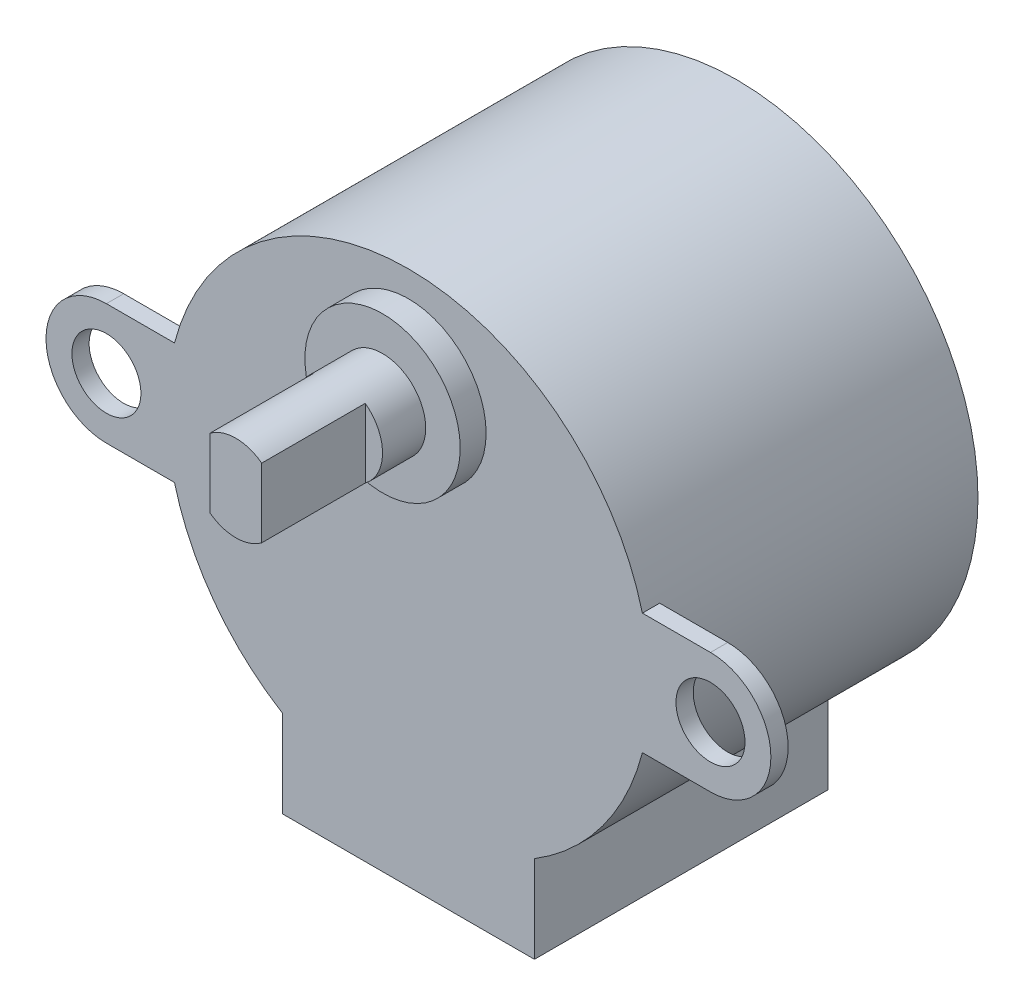
ISO-10303-21;
HEADER;
FILE_DESCRIPTION(('STEP AP214'),'2;1');
FILE_NAME('part.step','',(''),(''),'','','');
FILE_SCHEMA(('AUTOMOTIVE_DESIGN { 1 0 10303 214 1 1 1 1 }'));
ENDSEC;
DATA;
#1=APPLICATION_CONTEXT('core data for automotive mechanical design processes');
#2=APPLICATION_PROTOCOL_DEFINITION('international standard','automotive_design',2000,#1);
#3=PRODUCT_CONTEXT('',#1,'mechanical');
#4=PRODUCT('Part','Part','',(#3));
#5=PRODUCT_RELATED_PRODUCT_CATEGORY('part','',(#4));
#6=PRODUCT_DEFINITION_FORMATION('','',#4);
#7=PRODUCT_DEFINITION_CONTEXT('part definition',#1,'design');
#8=PRODUCT_DEFINITION('design','',#6,#7);
#9=PRODUCT_DEFINITION_SHAPE('','',#8);
#10=(LENGTH_UNIT() NAMED_UNIT(*) SI_UNIT(.MILLI.,.METRE.));
#11=(NAMED_UNIT(*) PLANE_ANGLE_UNIT() SI_UNIT($,.RADIAN.));
#12=(NAMED_UNIT(*) SI_UNIT($,.STERADIAN.) SOLID_ANGLE_UNIT());
#13=UNCERTAINTY_MEASURE_WITH_UNIT(LENGTH_MEASURE(1.E-05),#10,'distance_accuracy_value','');
#14=(GEOMETRIC_REPRESENTATION_CONTEXT(3) GLOBAL_UNCERTAINTY_ASSIGNED_CONTEXT((#13)) GLOBAL_UNIT_ASSIGNED_CONTEXT((#10,
#11,#12)) REPRESENTATION_CONTEXT('',''));
#15=CARTESIAN_POINT('',(0.,0.,0.));
#16=DIRECTION('',(0.,0.,1.));
#17=DIRECTION('',(1.,0.,0.));
#18=AXIS2_PLACEMENT_3D('',#15,#16,#17);
#19=CARTESIAN_POINT('',(0.,8.,23.));
#20=DIRECTION('',(0.,0.,1.));
#21=DIRECTION('',(1.,0.,0.));
#22=AXIS2_PLACEMENT_3D('',#19,#20,#21);
#23=PLANE('',#22);
#24=DIRECTION('',(0.,-1.,0.));
#25=VECTOR('',#24,1.);
#26=CARTESIAN_POINT('',(-1.5,6.,23.));
#27=LINE('',#26,#25);
#28=CARTESIAN_POINT('',(-1.5,10.,23.));
#29=VERTEX_POINT('',#28);
#30=CARTESIAN_POINT('',(-1.5,6.,23.));
#31=VERTEX_POINT('',#30);
#32=EDGE_CURVE('E166',#29,#31,#27,.T.);
#33=ORIENTED_EDGE('',*,*,#32,.F.);
#34=CARTESIAN_POINT('',(0.,8.,23.));
#35=DIRECTION('',(0.,0.,1.));
#36=DIRECTION('',(1.,0.,0.));
#37=AXIS2_PLACEMENT_3D('',#34,#35,#36);
#38=CIRCLE('',#37,2.5);
#39=EDGE_CURVE('E55',#29,#31,#38,.T.);
#40=ORIENTED_EDGE('',*,*,#39,.T.);
#41=EDGE_LOOP('',(#33,#40));
#42=FACE_BOUND('',#41,.T.);
#43=ADVANCED_FACE('F34',(#42),#23,.T.);
#44=CARTESIAN_POINT('',(0.,0.,19.));
#45=DIRECTION('',(0.,0.,-1.));
#46=DIRECTION('',(-1.,0.,0.));
#47=AXIS2_PLACEMENT_3D('',#44,#45,#46);
#48=CYLINDRICAL_SURFACE('',#47,14.);
#49=CARTESIAN_POINT('',(0.,0.,19.));
#50=DIRECTION('',(0.,0.,1.));
#51=DIRECTION('',(1.,0.,0.));
#52=AXIS2_PLACEMENT_3D('',#49,#50,#51);
#53=CIRCLE('',#52,14.);
#54=CARTESIAN_POINT('',(7.3,-11.9461290801665,19.));
#55=VERTEX_POINT('',#54);
#56=CARTESIAN_POINT('',(13.555441711726,-3.5,19.));
#57=VERTEX_POINT('',#56);
#58=EDGE_CURVE('E283',#55,#57,#53,.T.);
#59=ORIENTED_EDGE('',*,*,#58,.F.);
#60=DIRECTION('',(0.,0.,-1.));
#61=VECTOR('',#60,1.);
#62=CARTESIAN_POINT('',(7.3,-11.9461290801665,19.));
#63=LINE('',#62,#61);
#64=CARTESIAN_POINT('',(7.3,-11.9461290801665,2.));
#65=VERTEX_POINT('',#64);
#66=EDGE_CURVE('E199',#55,#65,#63,.T.);
#67=ORIENTED_EDGE('',*,*,#66,.T.);
#68=CARTESIAN_POINT('',(0.,0.,2.));
#69=DIRECTION('',(0.,0.,-1.));
#70=DIRECTION('',(-1.,0.,0.));
#71=AXIS2_PLACEMENT_3D('',#68,#69,#70);
#72=CIRCLE('',#71,14.);
#73=CARTESIAN_POINT('',(-7.3,-11.9461290801665,2.));
#74=VERTEX_POINT('',#73);
#75=EDGE_CURVE('E11',#65,#74,#72,.T.);
#76=ORIENTED_EDGE('',*,*,#75,.T.);
#77=DIRECTION('',(0.,0.,-1.));
#78=VECTOR('',#77,1.);
#79=CARTESIAN_POINT('',(-7.3,-11.9461290801665,19.));
#80=LINE('',#79,#78);
#81=CARTESIAN_POINT('',(-7.3,-11.9461290801665,19.));
#82=VERTEX_POINT('',#81);
#83=EDGE_CURVE('E194',#74,#82,#80,.F.);
#84=ORIENTED_EDGE('',*,*,#83,.T.);
#85=CARTESIAN_POINT('',(-13.555441711726,-3.50000000000001,19.));
#86=VERTEX_POINT('',#85);
#87=EDGE_CURVE('E282',#86,#82,#53,.T.);
#88=ORIENTED_EDGE('',*,*,#87,.F.);
#89=DIRECTION('',(0.,0.,1.));
#90=VECTOR('',#89,1.);
#91=CARTESIAN_POINT('',(-13.555441711726,-3.50000000000001,18.));
#92=LINE('',#91,#90);
#93=CARTESIAN_POINT('',(-13.555441711726,-3.50000000000001,18.));
#94=VERTEX_POINT('',#93);
#95=EDGE_CURVE('E233',#94,#86,#92,.T.);
#96=ORIENTED_EDGE('',*,*,#95,.F.);
#97=CARTESIAN_POINT('',(0.,0.,18.));
#98=DIRECTION('',(0.,0.,1.));
#99=DIRECTION('',(1.,0.,0.));
#100=AXIS2_PLACEMENT_3D('',#97,#98,#99);
#101=CIRCLE('',#100,14.);
#102=CARTESIAN_POINT('',(-13.555441711726,3.49999999999999,18.));
#103=VERTEX_POINT('',#102);
#104=EDGE_CURVE('E210',#103,#94,#101,.T.);
#105=ORIENTED_EDGE('',*,*,#104,.F.);
#106=DIRECTION('',(0.,0.,1.));
#107=VECTOR('',#106,1.);
#108=CARTESIAN_POINT('',(-13.555441711726,3.49999999999999,18.));
#109=LINE('',#108,#107);
#110=CARTESIAN_POINT('',(-13.555441711726,3.49999999999999,19.));
#111=VERTEX_POINT('',#110);
#112=EDGE_CURVE('E230',#103,#111,#109,.T.);
#113=ORIENTED_EDGE('',*,*,#112,.T.);
#114=CARTESIAN_POINT('',(13.555441711726,3.5,19.));
#115=VERTEX_POINT('',#114);
#116=EDGE_CURVE('E42',#115,#111,#53,.T.);
#117=ORIENTED_EDGE('',*,*,#116,.F.);
#118=DIRECTION('',(0.,0.,1.));
#119=VECTOR('',#118,1.);
#120=CARTESIAN_POINT('',(13.555441711726,3.5,18.));
#121=LINE('',#120,#119);
#122=CARTESIAN_POINT('',(13.555441711726,3.5,18.));
#123=VERTEX_POINT('',#122);
#124=EDGE_CURVE('E265',#123,#115,#121,.T.);
#125=ORIENTED_EDGE('',*,*,#124,.F.);
#126=CARTESIAN_POINT('',(0.,0.,18.));
#127=DIRECTION('',(0.,0.,1.));
#128=DIRECTION('',(1.,0.,0.));
#129=AXIS2_PLACEMENT_3D('',#126,#127,#128);
#130=CIRCLE('',#129,14.);
#131=CARTESIAN_POINT('',(13.555441711726,-3.5,18.));
#132=VERTEX_POINT('',#131);
#133=EDGE_CURVE('E249',#132,#123,#130,.T.);
#134=ORIENTED_EDGE('',*,*,#133,.F.);
#135=DIRECTION('',(0.,0.,1.));
#136=VECTOR('',#135,1.);
#137=CARTESIAN_POINT('',(13.555441711726,-3.5,18.));
#138=LINE('',#137,#136);
#139=EDGE_CURVE('E261',#132,#57,#138,.T.);
#140=ORIENTED_EDGE('',*,*,#139,.T.);
#141=EDGE_LOOP('',(#59,#67,#76,#84,#88,#96,#105,#113,#117,#125,#134,#140));
#142=FACE_BOUND('',#141,.T.);
#143=CARTESIAN_POINT('',(0.,0.,0.));
#144=DIRECTION('',(0.,0.,1.));
#145=DIRECTION('',(1.,0.,0.));
#146=AXIS2_PLACEMENT_3D('',#143,#144,#145);
#147=CIRCLE('',#146,14.);
#148=CARTESIAN_POINT('',(14.,0.,0.));
#149=VERTEX_POINT('',#148);
#150=EDGE_CURVE('E277',#149,#149,#147,.T.);
#151=ORIENTED_EDGE('',*,*,#150,.T.);
#152=EDGE_LOOP('',(#151));
#153=FACE_BOUND('',#152,.T.);
#154=ADVANCED_FACE('F36',(#142,#153),#48,.T.);
#155=CARTESIAN_POINT('',(0.,0.,19.));
#156=DIRECTION('',(0.,0.,1.));
#157=DIRECTION('',(1.,0.,0.));
#158=AXIS2_PLACEMENT_3D('',#155,#156,#157);
#159=PLANE('',#158);
#160=ORIENTED_EDGE('',*,*,#87,.T.);
#161=DIRECTION('',(0.,-1.,0.));
#162=VECTOR('',#161,1.);
#163=CARTESIAN_POINT('',(-7.3,-17.,19.));
#164=LINE('',#163,#162);
#165=CARTESIAN_POINT('',(-7.3,-17.,19.));
#166=VERTEX_POINT('',#165);
#167=EDGE_CURVE('E173',#82,#166,#164,.T.);
#168=ORIENTED_EDGE('',*,*,#167,.T.);
#169=DIRECTION('',(1.,0.,0.));
#170=VECTOR('',#169,1.);
#171=CARTESIAN_POINT('',(-7.3,-17.,19.));
#172=LINE('',#171,#170);
#173=CARTESIAN_POINT('',(7.3,-17.,19.));
#174=VERTEX_POINT('',#173);
#175=EDGE_CURVE('E183',#166,#174,#172,.T.);
#176=ORIENTED_EDGE('',*,*,#175,.T.);
#177=DIRECTION('',(0.,1.,0.));
#178=VECTOR('',#177,1.);
#179=CARTESIAN_POINT('',(7.3,-17.,19.));
#180=LINE('',#179,#178);
#181=EDGE_CURVE('E171',#174,#55,#180,.T.);
#182=ORIENTED_EDGE('',*,*,#181,.T.);
#183=ORIENTED_EDGE('',*,*,#58,.T.);
#184=DIRECTION('',(-1.,0.,0.));
#185=VECTOR('',#184,1.);
#186=CARTESIAN_POINT('',(0.,-3.5,19.));
#187=LINE('',#186,#185);
#188=CARTESIAN_POINT('',(17.5,-3.5,19.));
#189=VERTEX_POINT('',#188);
#190=EDGE_CURVE('E254',#189,#57,#187,.T.);
#191=ORIENTED_EDGE('',*,*,#190,.F.);
#192=CARTESIAN_POINT('',(17.5,0.,19.));
#193=DIRECTION('',(0.,0.,1.));
#194=DIRECTION('',(1.,0.,0.));
#195=AXIS2_PLACEMENT_3D('',#192,#193,#194);
#196=CIRCLE('',#195,3.5);
#197=CARTESIAN_POINT('',(17.5,3.5,19.));
#198=VERTEX_POINT('',#197);
#199=EDGE_CURVE('E257',#189,#198,#196,.T.);
#200=ORIENTED_EDGE('',*,*,#199,.T.);
#201=DIRECTION('',(-1.,0.,0.));
#202=VECTOR('',#201,1.);
#203=CARTESIAN_POINT('',(0.,3.5,19.));
#204=LINE('',#203,#202);
#205=EDGE_CURVE('E241',#198,#115,#204,.T.);
#206=ORIENTED_EDGE('',*,*,#205,.T.);
#207=ORIENTED_EDGE('',*,*,#116,.T.);
#208=DIRECTION('',(1.,0.,0.));
#209=VECTOR('',#208,1.);
#210=CARTESIAN_POINT('',(0.,3.49999999999999,19.));
#211=LINE('',#210,#209);
#212=CARTESIAN_POINT('',(-17.5,3.49999999999999,19.));
#213=VERTEX_POINT('',#212);
#214=EDGE_CURVE('E222',#213,#111,#211,.T.);
#215=ORIENTED_EDGE('',*,*,#214,.F.);
#216=CARTESIAN_POINT('',(-17.5,0.,19.));
#217=DIRECTION('',(0.,0.,1.));
#218=DIRECTION('',(1.,0.,0.));
#219=AXIS2_PLACEMENT_3D('',#216,#217,#218);
#220=CIRCLE('',#219,3.5);
#221=CARTESIAN_POINT('',(-17.5,-3.50000000000001,19.));
#222=VERTEX_POINT('',#221);
#223=EDGE_CURVE('E202',#222,#213,#220,.F.);
#224=ORIENTED_EDGE('',*,*,#223,.F.);
#225=DIRECTION('',(1.,0.,0.));
#226=VECTOR('',#225,1.);
#227=CARTESIAN_POINT('',(0.,-3.50000000000001,19.));
#228=LINE('',#227,#226);
#229=EDGE_CURVE('E220',#222,#86,#228,.T.);
#230=ORIENTED_EDGE('',*,*,#229,.T.);
#231=EDGE_LOOP('',(#160,#168,#176,#182,#183,#191,#200,#206,#207,#215,#224,#230));
#232=FACE_BOUND('',#231,.T.);
#233=CARTESIAN_POINT('',(0.,8.,19.));
#234=DIRECTION('',(0.,0.,1.));
#235=DIRECTION('',(1.,0.,0.));
#236=AXIS2_PLACEMENT_3D('',#233,#234,#235);
#237=CIRCLE('',#236,4.5);
#238=CARTESIAN_POINT('',(4.5,8.,19.));
#239=VERTEX_POINT('',#238);
#240=EDGE_CURVE('E278',#239,#239,#237,.T.);
#241=ORIENTED_EDGE('',*,*,#240,.F.);
#242=EDGE_LOOP('',(#241));
#243=FACE_BOUND('',#242,.T.);
#244=CARTESIAN_POINT('',(17.5,0.,19.));
#245=DIRECTION('',(0.,0.,1.));
#246=DIRECTION('',(1.,0.,0.));
#247=AXIS2_PLACEMENT_3D('',#244,#245,#246);
#248=CIRCLE('',#247,2.);
#249=CARTESIAN_POINT('',(19.5,0.,19.));
#250=VERTEX_POINT('',#249);
#251=EDGE_CURVE('E229',#250,#250,#248,.T.);
#252=ORIENTED_EDGE('',*,*,#251,.F.);
#253=EDGE_LOOP('',(#252));
#254=FACE_BOUND('',#253,.T.);
#255=CARTESIAN_POINT('',(-17.5,0.,19.));
#256=DIRECTION('',(0.,0.,1.));
#257=DIRECTION('',(1.,0.,0.));
#258=AXIS2_PLACEMENT_3D('',#255,#256,#257);
#259=CIRCLE('',#258,2.);
#260=CARTESIAN_POINT('',(-15.5,0.,19.));
#261=VERTEX_POINT('',#260);
#262=EDGE_CURVE('E207',#261,#261,#259,.F.);
#263=ORIENTED_EDGE('',*,*,#262,.T.);
#264=EDGE_LOOP('',(#263));
#265=FACE_BOUND('',#264,.T.);
#266=ADVANCED_FACE('F292',(#232,#243,#254,#265),#159,.T.);
#267=CARTESIAN_POINT('',(0.,0.,0.));
#268=DIRECTION('',(0.,0.,1.));
#269=DIRECTION('',(1.,0.,0.));
#270=AXIS2_PLACEMENT_3D('',#267,#268,#269);
#271=PLANE('',#270);
#272=ORIENTED_EDGE('',*,*,#150,.F.);
#273=EDGE_LOOP('',(#272));
#274=FACE_BOUND('',#273,.T.);
#275=ADVANCED_FACE('F353',(#274),#271,.F.);
#276=CARTESIAN_POINT('',(0.,8.,20.5));
#277=DIRECTION('',(0.,0.,-1.));
#278=DIRECTION('',(-1.,0.,0.));
#279=AXIS2_PLACEMENT_3D('',#276,#277,#278);
#280=CYLINDRICAL_SURFACE('',#279,4.5);
#281=CARTESIAN_POINT('',(0.,8.,20.5));
#282=DIRECTION('',(0.,0.,1.));
#283=DIRECTION('',(1.,0.,0.));
#284=AXIS2_PLACEMENT_3D('',#281,#282,#283);
#285=CIRCLE('',#284,4.5);
#286=CARTESIAN_POINT('',(4.5,8.,20.5));
#287=VERTEX_POINT('',#286);
#288=EDGE_CURVE('E274',#287,#287,#285,.T.);
#289=ORIENTED_EDGE('',*,*,#288,.F.);
#290=EDGE_LOOP('',(#289));
#291=FACE_BOUND('',#290,.T.);
#292=ORIENTED_EDGE('',*,*,#240,.T.);
#293=EDGE_LOOP('',(#292));
#294=FACE_BOUND('',#293,.T.);
#295=ADVANCED_FACE('F359',(#291,#294),#280,.T.);
#296=CARTESIAN_POINT('',(0.,8.,20.5));
#297=DIRECTION('',(0.,0.,1.));
#298=DIRECTION('',(1.,0.,0.));
#299=AXIS2_PLACEMENT_3D('',#296,#297,#298);
#300=PLANE('',#299);
#301=CARTESIAN_POINT('',(0.,8.,20.5));
#302=DIRECTION('',(0.,0.,1.));
#303=DIRECTION('',(1.,0.,0.));
#304=AXIS2_PLACEMENT_3D('',#301,#302,#303);
#305=CIRCLE('',#304,2.5);
#306=CARTESIAN_POINT('',(2.5,8.,20.5));
#307=VERTEX_POINT('',#306);
#308=EDGE_CURVE('E264',#307,#307,#305,.T.);
#309=ORIENTED_EDGE('',*,*,#308,.F.);
#310=EDGE_LOOP('',(#309));
#311=FACE_BOUND('',#310,.T.);
#312=ORIENTED_EDGE('',*,*,#288,.T.);
#313=EDGE_LOOP('',(#312));
#314=FACE_BOUND('',#313,.T.);
#315=ADVANCED_FACE('F375',(#311,#314),#300,.T.);
#316=CARTESIAN_POINT('',(0.,8.,23.));
#317=DIRECTION('',(0.,0.,-1.));
#318=DIRECTION('',(-1.,0.,0.));
#319=AXIS2_PLACEMENT_3D('',#316,#317,#318);
#320=CYLINDRICAL_SURFACE('',#319,2.5);
#321=ORIENTED_EDGE('',*,*,#39,.F.);
#322=DIRECTION('',(0.,0.,-1.));
#323=VECTOR('',#322,1.);
#324=CARTESIAN_POINT('',(-1.5,10.,29.));
#325=LINE('',#324,#323);
#326=CARTESIAN_POINT('',(-1.5,10.,29.));
#327=VERTEX_POINT('',#326);
#328=EDGE_CURVE('E175',#327,#29,#325,.T.);
#329=ORIENTED_EDGE('',*,*,#328,.F.);
#330=CARTESIAN_POINT('',(0.,8.,29.));
#331=DIRECTION('',(0.,0.,1.));
#332=DIRECTION('',(1.,0.,0.));
#333=AXIS2_PLACEMENT_3D('',#330,#331,#332);
#334=CIRCLE('',#333,2.5);
#335=CARTESIAN_POINT('',(1.5,10.,29.));
#336=VERTEX_POINT('',#335);
#337=EDGE_CURVE('E156',#336,#327,#334,.T.);
#338=ORIENTED_EDGE('',*,*,#337,.F.);
#339=DIRECTION('',(0.,0.,-1.));
#340=VECTOR('',#339,1.);
#341=CARTESIAN_POINT('',(1.5,10.,29.));
#342=LINE('',#341,#340);
#343=CARTESIAN_POINT('',(1.5,10.,23.));
#344=VERTEX_POINT('',#343);
#345=EDGE_CURVE('E153',#336,#344,#342,.T.);
#346=ORIENTED_EDGE('',*,*,#345,.T.);
#347=CARTESIAN_POINT('',(1.5,6.,23.));
#348=VERTEX_POINT('',#347);
#349=EDGE_CURVE('E170',#348,#344,#38,.T.);
#350=ORIENTED_EDGE('',*,*,#349,.F.);
#351=DIRECTION('',(0.,0.,-1.));
#352=VECTOR('',#351,1.);
#353=CARTESIAN_POINT('',(1.5,6.,29.));
#354=LINE('',#353,#352);
#355=CARTESIAN_POINT('',(1.5,6.,29.));
#356=VERTEX_POINT('',#355);
#357=EDGE_CURVE('E151',#356,#348,#354,.T.);
#358=ORIENTED_EDGE('',*,*,#357,.F.);
#359=CARTESIAN_POINT('',(0.,8.,29.));
#360=DIRECTION('',(0.,0.,1.));
#361=DIRECTION('',(1.,0.,0.));
#362=AXIS2_PLACEMENT_3D('',#359,#360,#361);
#363=CIRCLE('',#362,2.5);
#364=CARTESIAN_POINT('',(-1.5,6.,29.));
#365=VERTEX_POINT('',#364);
#366=EDGE_CURVE('E157',#365,#356,#363,.T.);
#367=ORIENTED_EDGE('',*,*,#366,.F.);
#368=DIRECTION('',(0.,0.,-1.));
#369=VECTOR('',#368,1.);
#370=CARTESIAN_POINT('',(-1.5,6.,29.));
#371=LINE('',#370,#369);
#372=EDGE_CURVE('E581',#365,#31,#371,.T.);
#373=ORIENTED_EDGE('',*,*,#372,.T.);
#374=EDGE_LOOP('',(#321,#329,#338,#346,#350,#358,#367,#373));
#375=FACE_BOUND('',#374,.T.);
#376=ORIENTED_EDGE('',*,*,#308,.T.);
#377=EDGE_LOOP('',(#376));
#378=FACE_BOUND('',#377,.T.);
#379=ADVANCED_FACE('F168',(#375,#378),#320,.T.);
#380=DIRECTION('',(0.,1.,0.));
#381=VECTOR('',#380,1.);
#382=CARTESIAN_POINT('',(1.5,6.,23.));
#383=LINE('',#382,#381);
#384=EDGE_CURVE('E48',#348,#344,#383,.T.);
#385=ORIENTED_EDGE('',*,*,#384,.F.);
#386=ORIENTED_EDGE('',*,*,#349,.T.);
#387=EDGE_LOOP('',(#385,#386));
#388=FACE_BOUND('',#387,.T.);
#389=ADVANCED_FACE('F364',(#388),#23,.T.);
#390=CARTESIAN_POINT('',(0.,-3.5,18.));
#391=DIRECTION('',(0.,1.,0.));
#392=DIRECTION('',(0.,0.,1.));
#393=AXIS2_PLACEMENT_3D('',#390,#391,#392);
#394=PLANE('',#393);
#395=ORIENTED_EDGE('',*,*,#190,.T.);
#396=ORIENTED_EDGE('',*,*,#139,.F.);
#397=DIRECTION('',(-1.,0.,0.));
#398=VECTOR('',#397,1.);
#399=CARTESIAN_POINT('',(0.,-3.5,18.));
#400=LINE('',#399,#398);
#401=CARTESIAN_POINT('',(17.5,-3.5,18.));
#402=VERTEX_POINT('',#401);
#403=EDGE_CURVE('E240',#402,#132,#400,.T.);
#404=ORIENTED_EDGE('',*,*,#403,.F.);
#405=DIRECTION('',(0.,0.,1.));
#406=VECTOR('',#405,1.);
#407=CARTESIAN_POINT('',(17.5,-3.5,18.));
#408=LINE('',#407,#406);
#409=EDGE_CURVE('E251',#402,#189,#408,.T.);
#410=ORIENTED_EDGE('',*,*,#409,.T.);
#411=EDGE_LOOP('',(#395,#396,#404,#410));
#412=FACE_BOUND('',#411,.T.);
#413=ADVANCED_FACE('F319',(#412),#394,.F.);
#414=CARTESIAN_POINT('',(0.,3.5,18.));
#415=DIRECTION('',(0.,1.,0.));
#416=DIRECTION('',(0.,0.,1.));
#417=AXIS2_PLACEMENT_3D('',#414,#415,#416);
#418=PLANE('',#417);
#419=ORIENTED_EDGE('',*,*,#205,.F.);
#420=DIRECTION('',(0.,0.,1.));
#421=VECTOR('',#420,1.);
#422=CARTESIAN_POINT('',(17.5,3.5,18.));
#423=LINE('',#422,#421);
#424=CARTESIAN_POINT('',(17.5,3.5,18.));
#425=VERTEX_POINT('',#424);
#426=EDGE_CURVE('E268',#425,#198,#423,.T.);
#427=ORIENTED_EDGE('',*,*,#426,.F.);
#428=DIRECTION('',(-1.,0.,0.));
#429=VECTOR('',#428,1.);
#430=CARTESIAN_POINT('',(0.,3.5,18.));
#431=LINE('',#430,#429);
#432=EDGE_CURVE('E246',#425,#123,#431,.T.);
#433=ORIENTED_EDGE('',*,*,#432,.T.);
#434=ORIENTED_EDGE('',*,*,#124,.T.);
#435=EDGE_LOOP('',(#419,#427,#433,#434));
#436=FACE_BOUND('',#435,.T.);
#437=ADVANCED_FACE('F327',(#436),#418,.T.);
#438=CARTESIAN_POINT('',(17.5,0.,18.));
#439=DIRECTION('',(0.,0.,1.));
#440=DIRECTION('',(1.,0.,0.));
#441=AXIS2_PLACEMENT_3D('',#438,#439,#440);
#442=CYLINDRICAL_SURFACE('',#441,2.);
#443=CARTESIAN_POINT('',(17.5,0.,18.));
#444=DIRECTION('',(0.,0.,1.));
#445=DIRECTION('',(1.,0.,0.));
#446=AXIS2_PLACEMENT_3D('',#443,#444,#445);
#447=CIRCLE('',#446,2.);
#448=CARTESIAN_POINT('',(19.5,0.,18.));
#449=VERTEX_POINT('',#448);
#450=EDGE_CURVE('E237',#449,#449,#447,.T.);
#451=ORIENTED_EDGE('',*,*,#450,.F.);
#452=EDGE_LOOP('',(#451));
#453=FACE_BOUND('',#452,.T.);
#454=ORIENTED_EDGE('',*,*,#251,.T.);
#455=EDGE_LOOP('',(#454));
#456=FACE_BOUND('',#455,.T.);
#457=ADVANCED_FACE('F391',(#453,#456),#442,.F.);
#458=CARTESIAN_POINT('',(17.5,0.,18.));
#459=DIRECTION('',(0.,0.,1.));
#460=DIRECTION('',(1.,0.,0.));
#461=AXIS2_PLACEMENT_3D('',#458,#459,#460);
#462=CYLINDRICAL_SURFACE('',#461,3.5);
#463=ORIENTED_EDGE('',*,*,#199,.F.);
#464=ORIENTED_EDGE('',*,*,#409,.F.);
#465=CARTESIAN_POINT('',(17.5,0.,18.));
#466=DIRECTION('',(0.,0.,1.));
#467=DIRECTION('',(1.,0.,0.));
#468=AXIS2_PLACEMENT_3D('',#465,#466,#467);
#469=CIRCLE('',#468,3.5);
#470=EDGE_CURVE('E243',#402,#425,#469,.T.);
#471=ORIENTED_EDGE('',*,*,#470,.T.);
#472=ORIENTED_EDGE('',*,*,#426,.T.);
#473=EDGE_LOOP('',(#463,#464,#471,#472));
#474=FACE_BOUND('',#473,.T.);
#475=ADVANCED_FACE('F323',(#474),#462,.T.);
#476=CARTESIAN_POINT('',(0.,0.,18.));
#477=DIRECTION('',(0.,0.,1.));
#478=DIRECTION('',(1.,0.,0.));
#479=AXIS2_PLACEMENT_3D('',#476,#477,#478);
#480=PLANE('',#479);
#481=ORIENTED_EDGE('',*,*,#450,.T.);
#482=EDGE_LOOP('',(#481));
#483=FACE_BOUND('',#482,.T.);
#484=ORIENTED_EDGE('',*,*,#403,.T.);
#485=ORIENTED_EDGE('',*,*,#133,.T.);
#486=ORIENTED_EDGE('',*,*,#432,.F.);
#487=ORIENTED_EDGE('',*,*,#470,.F.);
#488=EDGE_LOOP('',(#484,#485,#486,#487));
#489=FACE_BOUND('',#488,.T.);
#490=ADVANCED_FACE('F398',(#483,#489),#480,.F.);
#491=CARTESIAN_POINT('',(-17.5,0.,18.));
#492=DIRECTION('',(0.,0.,1.));
#493=DIRECTION('',(1.,0.,0.));
#494=AXIS2_PLACEMENT_3D('',#491,#492,#493);
#495=CYLINDRICAL_SURFACE('',#494,3.5);
#496=ORIENTED_EDGE('',*,*,#223,.T.);
#497=DIRECTION('',(0.,0.,1.));
#498=VECTOR('',#497,1.);
#499=CARTESIAN_POINT('',(-17.5,3.49999999999999,18.));
#500=LINE('',#499,#498);
#501=CARTESIAN_POINT('',(-17.5,3.49999999999999,18.));
#502=VERTEX_POINT('',#501);
#503=EDGE_CURVE('E226',#502,#213,#500,.T.);
#504=ORIENTED_EDGE('',*,*,#503,.F.);
#505=CARTESIAN_POINT('',(-17.5,0.,18.));
#506=DIRECTION('',(0.,0.,1.));
#507=DIRECTION('',(1.,0.,0.));
#508=AXIS2_PLACEMENT_3D('',#505,#506,#507);
#509=CIRCLE('',#508,3.5);
#510=CARTESIAN_POINT('',(-17.5,-3.50000000000001,18.));
#511=VERTEX_POINT('',#510);
#512=EDGE_CURVE('E203',#511,#502,#509,.F.);
#513=ORIENTED_EDGE('',*,*,#512,.F.);
#514=DIRECTION('',(0.,0.,1.));
#515=VECTOR('',#514,1.);
#516=CARTESIAN_POINT('',(-17.5,-3.50000000000001,18.));
#517=LINE('',#516,#515);
#518=EDGE_CURVE('E217',#511,#222,#517,.T.);
#519=ORIENTED_EDGE('',*,*,#518,.T.);
#520=EDGE_LOOP('',(#496,#504,#513,#519));
#521=FACE_BOUND('',#520,.T.);
#522=ADVANCED_FACE('F335',(#521),#495,.T.);
#523=CARTESIAN_POINT('',(0.,3.49999999999999,18.));
#524=DIRECTION('',(0.,-1.,0.));
#525=DIRECTION('',(0.,0.,-1.));
#526=AXIS2_PLACEMENT_3D('',#523,#524,#525);
#527=PLANE('',#526);
#528=ORIENTED_EDGE('',*,*,#214,.T.);
#529=ORIENTED_EDGE('',*,*,#112,.F.);
#530=DIRECTION('',(1.,0.,0.));
#531=VECTOR('',#530,1.);
#532=CARTESIAN_POINT('',(0.,3.49999999999999,18.));
#533=LINE('',#532,#531);
#534=EDGE_CURVE('E212',#502,#103,#533,.T.);
#535=ORIENTED_EDGE('',*,*,#534,.F.);
#536=ORIENTED_EDGE('',*,*,#503,.T.);
#537=EDGE_LOOP('',(#528,#529,#535,#536));
#538=FACE_BOUND('',#537,.T.);
#539=ADVANCED_FACE('F331',(#538),#527,.F.);
#540=CARTESIAN_POINT('',(0.,-3.50000000000001,18.));
#541=DIRECTION('',(0.,-1.,0.));
#542=DIRECTION('',(0.,0.,-1.));
#543=AXIS2_PLACEMENT_3D('',#540,#541,#542);
#544=PLANE('',#543);
#545=ORIENTED_EDGE('',*,*,#229,.F.);
#546=ORIENTED_EDGE('',*,*,#518,.F.);
#547=DIRECTION('',(1.,0.,0.));
#548=VECTOR('',#547,1.);
#549=CARTESIAN_POINT('',(0.,-3.50000000000001,18.));
#550=LINE('',#549,#548);
#551=EDGE_CURVE('E206',#511,#94,#550,.T.);
#552=ORIENTED_EDGE('',*,*,#551,.T.);
#553=ORIENTED_EDGE('',*,*,#95,.T.);
#554=EDGE_LOOP('',(#545,#546,#552,#553));
#555=FACE_BOUND('',#554,.T.);
#556=ADVANCED_FACE('F337',(#555),#544,.T.);
#557=CARTESIAN_POINT('',(-17.5,0.,18.));
#558=DIRECTION('',(0.,0.,1.));
#559=DIRECTION('',(1.,0.,0.));
#560=AXIS2_PLACEMENT_3D('',#557,#558,#559);
#561=CYLINDRICAL_SURFACE('',#560,2.);
#562=CARTESIAN_POINT('',(-17.5,0.,18.));
#563=DIRECTION('',(0.,0.,1.));
#564=DIRECTION('',(1.,0.,0.));
#565=AXIS2_PLACEMENT_3D('',#562,#563,#564);
#566=CIRCLE('',#565,2.);
#567=CARTESIAN_POINT('',(-15.5,0.,18.));
#568=VERTEX_POINT('',#567);
#569=EDGE_CURVE('E214',#568,#568,#566,.F.);
#570=ORIENTED_EDGE('',*,*,#569,.T.);
#571=EDGE_LOOP('',(#570));
#572=FACE_BOUND('',#571,.T.);
#573=ORIENTED_EDGE('',*,*,#262,.F.);
#574=EDGE_LOOP('',(#573));
#575=FACE_BOUND('',#574,.T.);
#576=ADVANCED_FACE('F343',(#572,#575),#561,.F.);
#577=CARTESIAN_POINT('',(0.,0.,18.));
#578=DIRECTION('',(0.,0.,1.));
#579=DIRECTION('',(1.,0.,0.));
#580=AXIS2_PLACEMENT_3D('',#577,#578,#579);
#581=PLANE('',#580);
#582=ORIENTED_EDGE('',*,*,#512,.T.);
#583=ORIENTED_EDGE('',*,*,#534,.T.);
#584=ORIENTED_EDGE('',*,*,#104,.T.);
#585=ORIENTED_EDGE('',*,*,#551,.F.);
#586=EDGE_LOOP('',(#582,#583,#584,#585));
#587=FACE_BOUND('',#586,.T.);
#588=ORIENTED_EDGE('',*,*,#569,.F.);
#589=EDGE_LOOP('',(#588));
#590=FACE_BOUND('',#589,.T.);
#591=ADVANCED_FACE('F340',(#587,#590),#581,.F.);
#592=CARTESIAN_POINT('',(7.3,-17.,2.));
#593=DIRECTION('',(1.,0.,0.));
#594=DIRECTION('',(0.,1.,0.));
#595=AXIS2_PLACEMENT_3D('',#592,#593,#594);
#596=PLANE('',#595);
#597=ORIENTED_EDGE('',*,*,#66,.F.);
#598=ORIENTED_EDGE('',*,*,#181,.F.);
#599=DIRECTION('',(0.,0.,1.));
#600=VECTOR('',#599,1.);
#601=CARTESIAN_POINT('',(7.3,-17.,2.));
#602=LINE('',#601,#600);
#603=CARTESIAN_POINT('',(7.3,-17.,2.));
#604=VERTEX_POINT('',#603);
#605=EDGE_CURVE('E192',#604,#174,#602,.T.);
#606=ORIENTED_EDGE('',*,*,#605,.F.);
#607=DIRECTION('',(0.,1.,0.));
#608=VECTOR('',#607,1.);
#609=CARTESIAN_POINT('',(7.3,-17.,2.));
#610=LINE('',#609,#608);
#611=EDGE_CURVE('E179',#604,#65,#610,.T.);
#612=ORIENTED_EDGE('',*,*,#611,.T.);
#613=EDGE_LOOP('',(#597,#598,#606,#612));
#614=FACE_BOUND('',#613,.T.);
#615=ADVANCED_FACE('F313',(#614),#596,.T.);
#616=CARTESIAN_POINT('',(-7.3,-17.,2.));
#617=DIRECTION('',(-1.,0.,0.));
#618=DIRECTION('',(0.,-1.,0.));
#619=AXIS2_PLACEMENT_3D('',#616,#617,#618);
#620=PLANE('',#619);
#621=ORIENTED_EDGE('',*,*,#83,.F.);
#622=DIRECTION('',(0.,-1.,0.));
#623=VECTOR('',#622,1.);
#624=CARTESIAN_POINT('',(-7.3,-17.,2.));
#625=LINE('',#624,#623);
#626=CARTESIAN_POINT('',(-7.3,-17.,2.));
#627=VERTEX_POINT('',#626);
#628=EDGE_CURVE('E182',#74,#627,#625,.T.);
#629=ORIENTED_EDGE('',*,*,#628,.T.);
#630=DIRECTION('',(0.,0.,1.));
#631=VECTOR('',#630,1.);
#632=CARTESIAN_POINT('',(-7.3,-17.,2.));
#633=LINE('',#632,#631);
#634=EDGE_CURVE('E187',#627,#166,#633,.T.);
#635=ORIENTED_EDGE('',*,*,#634,.T.);
#636=ORIENTED_EDGE('',*,*,#167,.F.);
#637=EDGE_LOOP('',(#621,#629,#635,#636));
#638=FACE_BOUND('',#637,.T.);
#639=ADVANCED_FACE('F301',(#638),#620,.T.);
#640=CARTESIAN_POINT('',(-7.3,-17.,2.));
#641=DIRECTION('',(0.,-1.,0.));
#642=DIRECTION('',(0.,0.,-1.));
#643=AXIS2_PLACEMENT_3D('',#640,#641,#642);
#644=PLANE('',#643);
#645=ORIENTED_EDGE('',*,*,#175,.F.);
#646=ORIENTED_EDGE('',*,*,#634,.F.);
#647=DIRECTION('',(1.,0.,0.));
#648=VECTOR('',#647,1.);
#649=CARTESIAN_POINT('',(-7.3,-17.,2.));
#650=LINE('',#649,#648);
#651=EDGE_CURVE('E185',#627,#604,#650,.T.);
#652=ORIENTED_EDGE('',*,*,#651,.T.);
#653=ORIENTED_EDGE('',*,*,#605,.T.);
#654=EDGE_LOOP('',(#645,#646,#652,#653));
#655=FACE_BOUND('',#654,.T.);
#656=ADVANCED_FACE('F309',(#655),#644,.T.);
#657=CARTESIAN_POINT('',(0.,0.,2.));
#658=DIRECTION('',(0.,0.,-1.));
#659=DIRECTION('',(-1.,0.,0.));
#660=AXIS2_PLACEMENT_3D('',#657,#658,#659);
#661=PLANE('',#660);
#662=ORIENTED_EDGE('',*,*,#75,.F.);
#663=ORIENTED_EDGE('',*,*,#611,.F.);
#664=ORIENTED_EDGE('',*,*,#651,.F.);
#665=ORIENTED_EDGE('',*,*,#628,.F.);
#666=EDGE_LOOP('',(#662,#663,#664,#665));
#667=FACE_BOUND('',#666,.T.);
#668=ADVANCED_FACE('F305',(#667),#661,.T.);
#669=CARTESIAN_POINT('',(1.5,6.,29.));
#670=DIRECTION('',(-1.,0.,0.));
#671=DIRECTION('',(0.,0.,1.));
#672=AXIS2_PLACEMENT_3D('',#669,#670,#671);
#673=PLANE('',#672);
#674=ORIENTED_EDGE('',*,*,#384,.T.);
#675=ORIENTED_EDGE('',*,*,#345,.F.);
#676=DIRECTION('',(0.,1.,0.));
#677=VECTOR('',#676,1.);
#678=CARTESIAN_POINT('',(1.5,6.,29.));
#679=LINE('',#678,#677);
#680=EDGE_CURVE('E147',#356,#336,#679,.T.);
#681=ORIENTED_EDGE('',*,*,#680,.F.);
#682=ORIENTED_EDGE('',*,*,#357,.T.);
#683=EDGE_LOOP('',(#674,#675,#681,#682));
#684=FACE_BOUND('',#683,.T.);
#685=ADVANCED_FACE('F149',(#684),#673,.F.);
#686=CARTESIAN_POINT('',(-1.5,6.,29.));
#687=DIRECTION('',(1.,0.,0.));
#688=DIRECTION('',(0.,0.,-1.));
#689=AXIS2_PLACEMENT_3D('',#686,#687,#688);
#690=PLANE('',#689);
#691=ORIENTED_EDGE('',*,*,#32,.T.);
#692=ORIENTED_EDGE('',*,*,#372,.F.);
#693=DIRECTION('',(0.,-1.,0.));
#694=VECTOR('',#693,1.);
#695=CARTESIAN_POINT('',(-1.5,6.,29.));
#696=LINE('',#695,#694);
#697=EDGE_CURVE('E162',#327,#365,#696,.T.);
#698=ORIENTED_EDGE('',*,*,#697,.F.);
#699=ORIENTED_EDGE('',*,*,#328,.T.);
#700=EDGE_LOOP('',(#691,#692,#698,#699));
#701=FACE_BOUND('',#700,.T.);
#702=ADVANCED_FACE('F422',(#701),#690,.F.);
#703=CARTESIAN_POINT('',(0.,8.,29.));
#704=DIRECTION('',(0.,0.,1.));
#705=DIRECTION('',(1.,0.,0.));
#706=AXIS2_PLACEMENT_3D('',#703,#704,#705);
#707=PLANE('',#706);
#708=ORIENTED_EDGE('',*,*,#366,.T.);
#709=ORIENTED_EDGE('',*,*,#680,.T.);
#710=ORIENTED_EDGE('',*,*,#337,.T.);
#711=ORIENTED_EDGE('',*,*,#697,.T.);
#712=EDGE_LOOP('',(#708,#709,#710,#711));
#713=FACE_BOUND('',#712,.T.);
#714=ADVANCED_FACE('F160',(#713),#707,.T.);
#715=CLOSED_SHELL('',(#43,#154,#266,#275,#295,#315,#379,#389,#413,#437,#457,#475,#490,#522,#539,
#556,#576,#591,#615,#639,#656,#668,#685,#702,#714));
#716=MANIFOLD_SOLID_BREP('B2',#715);
#717=ADVANCED_BREP_SHAPE_REPRESENTATION('',(#18,#716),#14);
#718=SHAPE_DEFINITION_REPRESENTATION(#9,#717);
ENDSEC;
END-ISO-10303-21;
